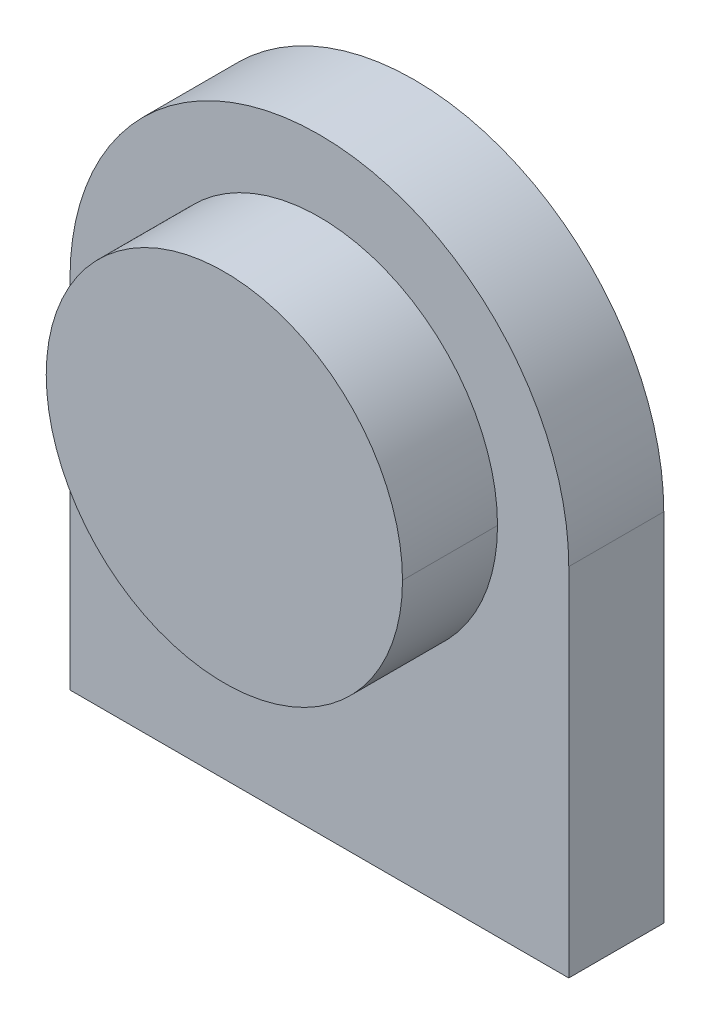
ISO-10303-21;
HEADER;
FILE_DESCRIPTION(('STEP AP214'),'2;1');
FILE_NAME('part.step','',(''),(''),'','','');
FILE_SCHEMA(('AUTOMOTIVE_DESIGN { 1 0 10303 214 1 1 1 1 }'));
ENDSEC;
DATA;
#1=APPLICATION_CONTEXT('core data for automotive mechanical design processes');
#2=APPLICATION_PROTOCOL_DEFINITION('international standard','automotive_design',2000,#1);
#3=PRODUCT_CONTEXT('',#1,'mechanical');
#4=PRODUCT('Part','Part','',(#3));
#5=PRODUCT_RELATED_PRODUCT_CATEGORY('part','',(#4));
#6=PRODUCT_DEFINITION_FORMATION('','',#4);
#7=PRODUCT_DEFINITION_CONTEXT('part definition',#1,'design');
#8=PRODUCT_DEFINITION('design','',#6,#7);
#9=PRODUCT_DEFINITION_SHAPE('','',#8);
#10=(LENGTH_UNIT() NAMED_UNIT(*) SI_UNIT(.MILLI.,.METRE.));
#11=(NAMED_UNIT(*) PLANE_ANGLE_UNIT() SI_UNIT($,.RADIAN.));
#12=(NAMED_UNIT(*) SI_UNIT($,.STERADIAN.) SOLID_ANGLE_UNIT());
#13=UNCERTAINTY_MEASURE_WITH_UNIT(LENGTH_MEASURE(1.E-05),#10,'distance_accuracy_value','');
#14=(GEOMETRIC_REPRESENTATION_CONTEXT(3) GLOBAL_UNCERTAINTY_ASSIGNED_CONTEXT((#13)) GLOBAL_UNIT_ASSIGNED_CONTEXT((#10,
#11,#12)) REPRESENTATION_CONTEXT('',''));
#15=CARTESIAN_POINT('',(0.,0.,0.));
#16=DIRECTION('',(0.,0.,1.));
#17=DIRECTION('',(1.,0.,0.));
#18=AXIS2_PLACEMENT_3D('',#15,#16,#17);
#19=CARTESIAN_POINT('',(0.,0.,5.));
#20=DIRECTION('',(0.,0.,-1.));
#21=DIRECTION('',(-1.,0.,0.));
#22=AXIS2_PLACEMENT_3D('',#19,#20,#21);
#23=CYLINDRICAL_SURFACE('',#22,7.5);
#24=DIRECTION('',(0.,0.,-1.));
#25=VECTOR('',#24,1.);
#26=CARTESIAN_POINT('',(-7.5,0.,5.));
#27=LINE('',#26,#25);
#28=CARTESIAN_POINT('',(-7.5,0.,4.));
#29=VERTEX_POINT('',#28);
#30=CARTESIAN_POINT('',(-7.5,0.,0.));
#31=VERTEX_POINT('',#30);
#32=EDGE_CURVE('E167',#29,#31,#27,.T.);
#33=ORIENTED_EDGE('',*,*,#32,.F.);
#34=CARTESIAN_POINT('',(0.,0.,4.));
#35=DIRECTION('',(0.,0.,1.));
#36=DIRECTION('',(1.,0.,0.));
#37=AXIS2_PLACEMENT_3D('',#34,#35,#36);
#38=CIRCLE('',#37,7.5);
#39=CARTESIAN_POINT('',(7.5,0.,4.));
#40=VERTEX_POINT('',#39);
#41=EDGE_CURVE('E68',#40,#29,#38,.T.);
#42=ORIENTED_EDGE('',*,*,#41,.F.);
#43=DIRECTION('',(0.,0.,-1.));
#44=VECTOR('',#43,1.);
#45=CARTESIAN_POINT('',(7.5,0.,5.));
#46=LINE('',#45,#44);
#47=CARTESIAN_POINT('',(7.5,0.,0.));
#48=VERTEX_POINT('',#47);
#49=EDGE_CURVE('E101',#40,#48,#46,.T.);
#50=ORIENTED_EDGE('',*,*,#49,.T.);
#51=CARTESIAN_POINT('',(0.,0.,0.));
#52=DIRECTION('',(0.,0.,1.));
#53=DIRECTION('',(1.,0.,0.));
#54=AXIS2_PLACEMENT_3D('',#51,#52,#53);
#55=CIRCLE('',#54,7.5);
#56=EDGE_CURVE('E170',#48,#31,#55,.T.);
#57=ORIENTED_EDGE('',*,*,#56,.T.);
#58=EDGE_LOOP('',(#33,#42,#50,#57));
#59=FACE_BOUND('',#58,.T.);
#60=ADVANCED_FACE('F51',(#59),#23,.T.);
#61=CARTESIAN_POINT('',(0.,0.,5.));
#62=DIRECTION('',(0.,0.,-1.));
#63=DIRECTION('',(-1.,0.,0.));
#64=AXIS2_PLACEMENT_3D('',#61,#62,#63);
#65=CYLINDRICAL_SURFACE('',#64,7.5);
#66=ORIENTED_EDGE('',*,*,#49,.F.);
#67=EDGE_CURVE('E366',#29,#40,#38,.T.);
#68=ORIENTED_EDGE('',*,*,#67,.F.);
#69=ORIENTED_EDGE('',*,*,#32,.T.);
#70=CARTESIAN_POINT('',(0.,0.,0.));
#71=DIRECTION('',(0.,0.,1.));
#72=DIRECTION('',(1.,0.,0.));
#73=AXIS2_PLACEMENT_3D('',#70,#71,#72);
#74=CIRCLE('',#73,7.5);
#75=EDGE_CURVE('E125',#31,#48,#74,.T.);
#76=ORIENTED_EDGE('',*,*,#75,.T.);
#77=EDGE_LOOP('',(#66,#68,#69,#76));
#78=FACE_BOUND('',#77,.T.);
#79=ADVANCED_FACE('F269',(#78),#65,.T.);
#80=CARTESIAN_POINT('',(0.,0.,-4.));
#81=DIRECTION('',(0.,0.,1.));
#82=DIRECTION('',(1.,0.,0.));
#83=AXIS2_PLACEMENT_3D('',#80,#81,#82);
#84=CYLINDRICAL_SURFACE('',#83,10.5);
#85=CARTESIAN_POINT('',(0.,0.,-4.));
#86=DIRECTION('',(0.,0.,-1.));
#87=DIRECTION('',(-1.,0.,0.));
#88=AXIS2_PLACEMENT_3D('',#85,#86,#87);
#89=CIRCLE('',#88,10.5);
#90=CARTESIAN_POINT('',(-10.5,0.,-4.));
#91=VERTEX_POINT('',#90);
#92=CARTESIAN_POINT('',(10.5,0.,-4.));
#93=VERTEX_POINT('',#92);
#94=EDGE_CURVE('E55',#91,#93,#89,.T.);
#95=ORIENTED_EDGE('',*,*,#94,.F.);
#96=DIRECTION('',(0.,0.,1.));
#97=VECTOR('',#96,1.);
#98=CARTESIAN_POINT('',(-10.5,0.,-4.));
#99=LINE('',#98,#97);
#100=CARTESIAN_POINT('',(-10.5,0.,0.));
#101=VERTEX_POINT('',#100);
#102=EDGE_CURVE('E12',#91,#101,#99,.T.);
#103=ORIENTED_EDGE('',*,*,#102,.T.);
#104=CARTESIAN_POINT('',(0.,0.,0.));
#105=DIRECTION('',(0.,0.,-1.));
#106=DIRECTION('',(-1.,0.,0.));
#107=AXIS2_PLACEMENT_3D('',#104,#105,#106);
#108=CIRCLE('',#107,10.5);
#109=CARTESIAN_POINT('',(10.5,0.,0.));
#110=VERTEX_POINT('',#109);
#111=EDGE_CURVE('E61',#101,#110,#108,.T.);
#112=ORIENTED_EDGE('',*,*,#111,.T.);
#113=DIRECTION('',(0.,0.,1.));
#114=VECTOR('',#113,1.);
#115=CARTESIAN_POINT('',(10.5,0.,-4.));
#116=LINE('',#115,#114);
#117=EDGE_CURVE('E116',#93,#110,#116,.T.);
#118=ORIENTED_EDGE('',*,*,#117,.F.);
#119=EDGE_LOOP('',(#95,#103,#112,#118));
#120=FACE_BOUND('',#119,.T.);
#121=ADVANCED_FACE('F119',(#120),#84,.T.);
#122=CARTESIAN_POINT('',(0.,0.,-4.));
#123=DIRECTION('',(0.,0.,-1.));
#124=DIRECTION('',(0.,-1.,0.));
#125=AXIS2_PLACEMENT_3D('',#122,#123,#124);
#126=PLANE('',#125);
#127=CARTESIAN_POINT('',(0.,0.,-4.));
#128=DIRECTION('',(0.,0.,-1.));
#129=DIRECTION('',(0.,1.,0.));
#130=AXIS2_PLACEMENT_3D('',#127,#128,#129);
#131=CIRCLE('',#130,9.25);
#132=CARTESIAN_POINT('',(0.,9.25,-4.));
#133=VERTEX_POINT('',#132);
#134=EDGE_CURVE('E155',#133,#133,#131,.T.);
#135=ORIENTED_EDGE('',*,*,#134,.F.);
#136=EDGE_LOOP('',(#135));
#137=FACE_BOUND('',#136,.T.);
#138=ORIENTED_EDGE('',*,*,#94,.T.);
#139=DIRECTION('',(0.,1.,0.));
#140=VECTOR('',#139,1.);
#141=CARTESIAN_POINT('',(10.5,0.,-4.));
#142=LINE('',#141,#140);
#143=CARTESIAN_POINT('',(10.5,-15.,-4.));
#144=VERTEX_POINT('',#143);
#145=EDGE_CURVE('E111',#144,#93,#142,.T.);
#146=ORIENTED_EDGE('',*,*,#145,.F.);
#147=DIRECTION('',(-1.,0.,0.));
#148=VECTOR('',#147,1.);
#149=CARTESIAN_POINT('',(0.,-15.,-4.));
#150=LINE('',#149,#148);
#151=CARTESIAN_POINT('',(-10.5,-15.,-4.));
#152=VERTEX_POINT('',#151);
#153=EDGE_CURVE('E134',#144,#152,#150,.T.);
#154=ORIENTED_EDGE('',*,*,#153,.T.);
#155=DIRECTION('',(0.,1.,0.));
#156=VECTOR('',#155,1.);
#157=CARTESIAN_POINT('',(-10.5,0.,-4.));
#158=LINE('',#157,#156);
#159=EDGE_CURVE('E113',#152,#91,#158,.T.);
#160=ORIENTED_EDGE('',*,*,#159,.T.);
#161=EDGE_LOOP('',(#138,#146,#154,#160));
#162=FACE_BOUND('',#161,.T.);
#163=ADVANCED_FACE('F108',(#137,#162),#126,.T.);
#164=CARTESIAN_POINT('',(0.,0.,0.));
#165=DIRECTION('',(0.,0.,-1.));
#166=DIRECTION('',(0.,-1.,0.));
#167=AXIS2_PLACEMENT_3D('',#164,#165,#166);
#168=PLANE('',#167);
#169=ORIENTED_EDGE('',*,*,#111,.F.);
#170=DIRECTION('',(0.,1.,0.));
#171=VECTOR('',#170,1.);
#172=CARTESIAN_POINT('',(-10.5,0.,0.));
#173=LINE('',#172,#171);
#174=CARTESIAN_POINT('',(-10.5,-15.,0.));
#175=VERTEX_POINT('',#174);
#176=EDGE_CURVE('E143',#175,#101,#173,.T.);
#177=ORIENTED_EDGE('',*,*,#176,.F.);
#178=DIRECTION('',(-1.,0.,0.));
#179=VECTOR('',#178,1.);
#180=CARTESIAN_POINT('',(0.,-15.,0.));
#181=LINE('',#180,#179);
#182=CARTESIAN_POINT('',(10.5,-15.,0.));
#183=VERTEX_POINT('',#182);
#184=EDGE_CURVE('E147',#183,#175,#181,.T.);
#185=ORIENTED_EDGE('',*,*,#184,.F.);
#186=DIRECTION('',(0.,1.,0.));
#187=VECTOR('',#186,1.);
#188=CARTESIAN_POINT('',(10.5,0.,0.));
#189=LINE('',#188,#187);
#190=EDGE_CURVE('E151',#183,#110,#189,.T.);
#191=ORIENTED_EDGE('',*,*,#190,.T.);
#192=EDGE_LOOP('',(#169,#177,#185,#191));
#193=FACE_BOUND('',#192,.T.);
#194=ORIENTED_EDGE('',*,*,#75,.F.);
#195=ORIENTED_EDGE('',*,*,#56,.F.);
#196=EDGE_LOOP('',(#194,#195));
#197=FACE_BOUND('',#196,.T.);
#198=ADVANCED_FACE('F209',(#193,#197),#168,.F.);
#199=CARTESIAN_POINT('',(0.,0.,-4.));
#200=DIRECTION('',(0.,0.,-1.));
#201=DIRECTION('',(0.,1.,0.));
#202=AXIS2_PLACEMENT_3D('',#199,#200,#201);
#203=CONICAL_SURFACE('',#202,9.25,0.785398163397449);
#204=CARTESIAN_POINT('',(0.,0.,-3.25));
#205=DIRECTION('',(0.,0.,-1.));
#206=DIRECTION('',(0.,1.,0.));
#207=AXIS2_PLACEMENT_3D('',#204,#205,#206);
#208=CIRCLE('',#207,8.5);
#209=CARTESIAN_POINT('',(0.,8.5,-3.25));
#210=VERTEX_POINT('',#209);
#211=EDGE_CURVE('E160',#210,#210,#208,.T.);
#212=ORIENTED_EDGE('',*,*,#211,.F.);
#213=EDGE_LOOP('',(#212));
#214=FACE_BOUND('',#213,.T.);
#215=ORIENTED_EDGE('',*,*,#134,.T.);
#216=EDGE_LOOP('',(#215));
#217=FACE_BOUND('',#216,.T.);
#218=ADVANCED_FACE('F205',(#214,#217),#203,.F.);
#219=CARTESIAN_POINT('',(0.,0.,-1.));
#220=DIRECTION('',(0.,0.,-1.));
#221=DIRECTION('',(0.,-1.,0.));
#222=AXIS2_PLACEMENT_3D('',#219,#220,#221);
#223=PLANE('',#222);
#224=CARTESIAN_POINT('',(0.,0.,-1.));
#225=DIRECTION('',(0.,0.,-1.));
#226=DIRECTION('',(-1.,0.,0.));
#227=AXIS2_PLACEMENT_3D('',#224,#225,#226);
#228=CIRCLE('',#227,8.5);
#229=CARTESIAN_POINT('',(-8.5,0.,-1.));
#230=VERTEX_POINT('',#229);
#231=EDGE_CURVE('E117',#230,#230,#228,.T.);
#232=ORIENTED_EDGE('',*,*,#231,.T.);
#233=EDGE_LOOP('',(#232));
#234=FACE_BOUND('',#233,.T.);
#235=ADVANCED_FACE('F53',(#234),#223,.T.);
#236=CARTESIAN_POINT('',(0.,0.,-1.));
#237=DIRECTION('',(0.,0.,-1.));
#238=DIRECTION('',(-1.,0.,0.));
#239=AXIS2_PLACEMENT_3D('',#236,#237,#238);
#240=CYLINDRICAL_SURFACE('',#239,8.5);
#241=ORIENTED_EDGE('',*,*,#211,.T.);
#242=EDGE_LOOP('',(#241));
#243=FACE_BOUND('',#242,.T.);
#244=ORIENTED_EDGE('',*,*,#231,.F.);
#245=EDGE_LOOP('',(#244));
#246=FACE_BOUND('',#245,.T.);
#247=ADVANCED_FACE('F218',(#243,#246),#240,.F.);
#248=CARTESIAN_POINT('',(-10.5,0.,-4.));
#249=DIRECTION('',(1.,0.,0.));
#250=DIRECTION('',(0.,0.,-1.));
#251=AXIS2_PLACEMENT_3D('',#248,#249,#250);
#252=PLANE('',#251);
#253=ORIENTED_EDGE('',*,*,#176,.T.);
#254=ORIENTED_EDGE('',*,*,#102,.F.);
#255=ORIENTED_EDGE('',*,*,#159,.F.);
#256=DIRECTION('',(0.,0.,1.));
#257=VECTOR('',#256,1.);
#258=CARTESIAN_POINT('',(-10.5,-15.,-4.));
#259=LINE('',#258,#257);
#260=EDGE_CURVE('E133',#152,#175,#259,.T.);
#261=ORIENTED_EDGE('',*,*,#260,.T.);
#262=EDGE_LOOP('',(#253,#254,#255,#261));
#263=FACE_BOUND('',#262,.T.);
#264=ADVANCED_FACE('F224',(#263),#252,.F.);
#265=CARTESIAN_POINT('',(10.5,0.,-4.));
#266=DIRECTION('',(1.,0.,0.));
#267=DIRECTION('',(0.,1.,0.));
#268=AXIS2_PLACEMENT_3D('',#265,#266,#267);
#269=PLANE('',#268);
#270=ORIENTED_EDGE('',*,*,#190,.F.);
#271=DIRECTION('',(0.,0.,1.));
#272=VECTOR('',#271,1.);
#273=CARTESIAN_POINT('',(10.5,-15.,-4.));
#274=LINE('',#273,#272);
#275=EDGE_CURVE('E130',#144,#183,#274,.T.);
#276=ORIENTED_EDGE('',*,*,#275,.F.);
#277=ORIENTED_EDGE('',*,*,#145,.T.);
#278=ORIENTED_EDGE('',*,*,#117,.T.);
#279=EDGE_LOOP('',(#270,#276,#277,#278));
#280=FACE_BOUND('',#279,.T.);
#281=ADVANCED_FACE('F128',(#280),#269,.T.);
#282=CARTESIAN_POINT('',(0.,-15.,-4.));
#283=DIRECTION('',(0.,1.,0.));
#284=DIRECTION('',(-1.,0.,0.));
#285=AXIS2_PLACEMENT_3D('',#282,#283,#284);
#286=PLANE('',#285);
#287=ORIENTED_EDGE('',*,*,#184,.T.);
#288=ORIENTED_EDGE('',*,*,#260,.F.);
#289=ORIENTED_EDGE('',*,*,#153,.F.);
#290=ORIENTED_EDGE('',*,*,#275,.T.);
#291=EDGE_LOOP('',(#287,#288,#289,#290));
#292=FACE_BOUND('',#291,.T.);
#293=ADVANCED_FACE('F254',(#292),#286,.F.);
#294=CARTESIAN_POINT('',(0.,0.,4.));
#295=DIRECTION('',(0.,0.,1.));
#296=DIRECTION('',(1.,0.,0.));
#297=AXIS2_PLACEMENT_3D('',#294,#295,#296);
#298=PLANE('',#297);
#299=ORIENTED_EDGE('',*,*,#41,.T.);
#300=ORIENTED_EDGE('',*,*,#67,.T.);
#301=EDGE_LOOP('',(#299,#300));
#302=FACE_BOUND('',#301,.T.);
#303=ADVANCED_FACE('F260',(#302),#298,.T.);
#304=CLOSED_SHELL('',(#60,#79,#121,#163,#198,#218,#235,#247,#264,#281,#293,#303));
#305=MANIFOLD_SOLID_BREP('B2',#304);
#306=ADVANCED_BREP_SHAPE_REPRESENTATION('',(#18,#305),#14);
#307=SHAPE_DEFINITION_REPRESENTATION(#9,#306);
ENDSEC;
END-ISO-10303-21;
